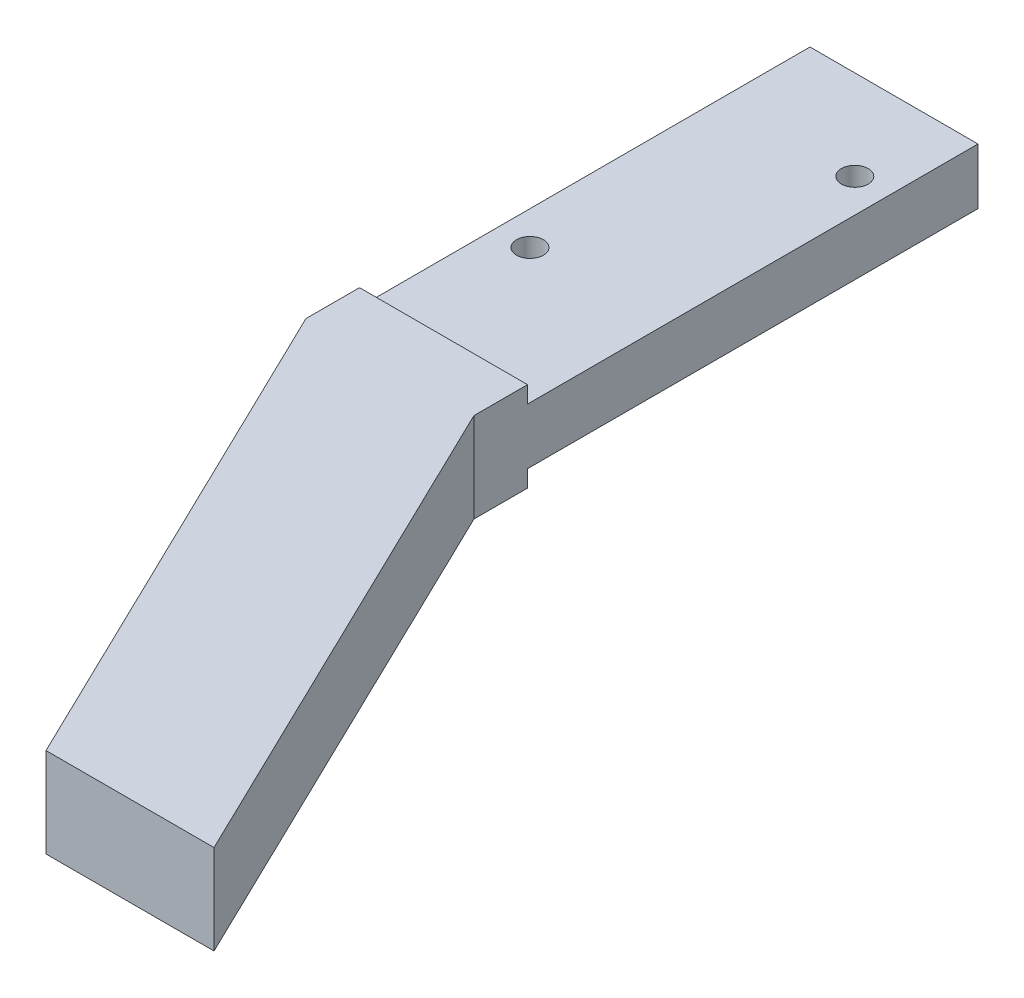
ISO-10303-21;
HEADER;
FILE_DESCRIPTION(('STEP AP214'),'2;1');
FILE_NAME('part.step','',(''),(''),'','','');
FILE_SCHEMA(('AUTOMOTIVE_DESIGN { 1 0 10303 214 1 1 1 1 }'));
ENDSEC;
DATA;
#1=APPLICATION_CONTEXT('core data for automotive mechanical design processes');
#2=APPLICATION_PROTOCOL_DEFINITION('international standard','automotive_design',2000,#1);
#3=PRODUCT_CONTEXT('',#1,'mechanical');
#4=PRODUCT('Part','Part','',(#3));
#5=PRODUCT_RELATED_PRODUCT_CATEGORY('part','',(#4));
#6=PRODUCT_DEFINITION_FORMATION('','',#4);
#7=PRODUCT_DEFINITION_CONTEXT('part definition',#1,'design');
#8=PRODUCT_DEFINITION('design','',#6,#7);
#9=PRODUCT_DEFINITION_SHAPE('','',#8);
#10=(LENGTH_UNIT() NAMED_UNIT(*) SI_UNIT(.MILLI.,.METRE.));
#11=(NAMED_UNIT(*) PLANE_ANGLE_UNIT() SI_UNIT($,.RADIAN.));
#12=(NAMED_UNIT(*) SI_UNIT($,.STERADIAN.) SOLID_ANGLE_UNIT());
#13=UNCERTAINTY_MEASURE_WITH_UNIT(LENGTH_MEASURE(1.E-05),#10,'distance_accuracy_value','');
#14=(GEOMETRIC_REPRESENTATION_CONTEXT(3) GLOBAL_UNCERTAINTY_ASSIGNED_CONTEXT((#13)) GLOBAL_UNIT_ASSIGNED_CONTEXT((#10,
#11,#12)) REPRESENTATION_CONTEXT('',''));
#15=CARTESIAN_POINT('',(0.,0.,0.));
#16=DIRECTION('',(0.,0.,1.));
#17=DIRECTION('',(1.,0.,0.));
#18=AXIS2_PLACEMENT_3D('',#15,#16,#17);
#19=CARTESIAN_POINT('',(0.,2.5,0.));
#20=DIRECTION('',(0.,1.,0.));
#21=DIRECTION('',(0.,0.,1.));
#22=AXIS2_PLACEMENT_3D('',#19,#20,#21);
#23=PLANE('',#22);
#24=DIRECTION('',(-1.,0.,0.));
#25=VECTOR('',#24,1.);
#26=CARTESIAN_POINT('',(0.,2.5,17.7156622283973));
#27=LINE('',#26,#25);
#28=CARTESIAN_POINT('',(7.5,2.5,17.7156622283973));
#29=VERTEX_POINT('',#28);
#30=CARTESIAN_POINT('',(-7.5,2.5,17.7156622283973));
#31=VERTEX_POINT('',#30);
#32=EDGE_CURVE('E81',#29,#31,#27,.T.);
#33=ORIENTED_EDGE('',*,*,#32,.F.);
#34=DIRECTION('',(0.,0.,-1.));
#35=VECTOR('',#34,1.);
#36=CARTESIAN_POINT('',(7.5,2.5,22.5));
#37=LINE('',#36,#35);
#38=CARTESIAN_POINT('',(7.5,2.5,-22.5));
#39=VERTEX_POINT('',#38);
#40=EDGE_CURVE('E226',#29,#39,#37,.T.);
#41=ORIENTED_EDGE('',*,*,#40,.T.);
#42=DIRECTION('',(-1.,0.,0.));
#43=VECTOR('',#42,1.);
#44=CARTESIAN_POINT('',(7.5,2.5,-22.5));
#45=LINE('',#44,#43);
#46=CARTESIAN_POINT('',(-7.5,2.5,-22.5));
#47=VERTEX_POINT('',#46);
#48=EDGE_CURVE('E61',#39,#47,#45,.T.);
#49=ORIENTED_EDGE('',*,*,#48,.T.);
#50=DIRECTION('',(0.,0.,1.));
#51=VECTOR('',#50,1.);
#52=CARTESIAN_POINT('',(-7.5,2.5,22.5));
#53=LINE('',#52,#51);
#54=EDGE_CURVE('E223',#47,#31,#53,.T.);
#55=ORIENTED_EDGE('',*,*,#54,.T.);
#56=EDGE_LOOP('',(#33,#41,#49,#55));
#57=FACE_BOUND('',#56,.T.);
#58=CARTESIAN_POINT('',(4.5,2.5,-14.5));
#59=DIRECTION('',(0.,1.,0.));
#60=DIRECTION('',(0.,0.,1.));
#61=AXIS2_PLACEMENT_3D('',#58,#59,#60);
#62=CIRCLE('',#61,1.2);
#63=CARTESIAN_POINT('',(4.5,2.5,-13.3));
#64=VERTEX_POINT('',#63);
#65=EDGE_CURVE('E216',#64,#64,#62,.T.);
#66=ORIENTED_EDGE('',*,*,#65,.F.);
#67=EDGE_LOOP('',(#66));
#68=FACE_BOUND('',#67,.T.);
#69=CARTESIAN_POINT('',(-4.5,2.5,5.50000000000001));
#70=DIRECTION('',(0.,1.,0.));
#71=DIRECTION('',(0.,0.,1.));
#72=AXIS2_PLACEMENT_3D('',#69,#70,#71);
#73=CIRCLE('',#72,1.2);
#74=CARTESIAN_POINT('',(-4.5,2.5,6.70000000000001));
#75=VERTEX_POINT('',#74);
#76=EDGE_CURVE('E208',#75,#75,#73,.T.);
#77=ORIENTED_EDGE('',*,*,#76,.F.);
#78=EDGE_LOOP('',(#77));
#79=FACE_BOUND('',#78,.T.);
#80=ADVANCED_FACE('F43',(#57,#68,#79),#23,.T.);
#81=CARTESIAN_POINT('',(0.,-2.5,0.));
#82=DIRECTION('',(0.,1.,0.));
#83=DIRECTION('',(0.,0.,1.));
#84=AXIS2_PLACEMENT_3D('',#81,#82,#83);
#85=PLANE('',#84);
#86=DIRECTION('',(0.,0.,-1.));
#87=VECTOR('',#86,1.);
#88=CARTESIAN_POINT('',(7.5,-2.5,22.5));
#89=LINE('',#88,#87);
#90=CARTESIAN_POINT('',(7.5,-2.5,17.7156622283973));
#91=VERTEX_POINT('',#90);
#92=CARTESIAN_POINT('',(7.5,-2.5,-22.5));
#93=VERTEX_POINT('',#92);
#94=EDGE_CURVE('E72',#91,#93,#89,.T.);
#95=ORIENTED_EDGE('',*,*,#94,.F.);
#96=DIRECTION('',(-1.,0.,0.));
#97=VECTOR('',#96,1.);
#98=CARTESIAN_POINT('',(0.,-2.5,17.7156622283973));
#99=LINE('',#98,#97);
#100=CARTESIAN_POINT('',(-7.5,-2.5,17.7156622283973));
#101=VERTEX_POINT('',#100);
#102=EDGE_CURVE('E196',#91,#101,#99,.T.);
#103=ORIENTED_EDGE('',*,*,#102,.T.);
#104=DIRECTION('',(0.,0.,1.));
#105=VECTOR('',#104,1.);
#106=CARTESIAN_POINT('',(-7.5,-2.5,22.5));
#107=LINE('',#106,#105);
#108=CARTESIAN_POINT('',(-7.5,-2.5,-22.5));
#109=VERTEX_POINT('',#108);
#110=EDGE_CURVE('E132',#109,#101,#107,.T.);
#111=ORIENTED_EDGE('',*,*,#110,.F.);
#112=DIRECTION('',(-1.,0.,0.));
#113=VECTOR('',#112,1.);
#114=CARTESIAN_POINT('',(7.5,-2.5,-22.5));
#115=LINE('',#114,#113);
#116=EDGE_CURVE('E227',#93,#109,#115,.T.);
#117=ORIENTED_EDGE('',*,*,#116,.F.);
#118=EDGE_LOOP('',(#95,#103,#111,#117));
#119=FACE_BOUND('',#118,.T.);
#120=CARTESIAN_POINT('',(4.5,-2.5,-14.5));
#121=DIRECTION('',(0.,1.,0.));
#122=DIRECTION('',(0.,0.,1.));
#123=AXIS2_PLACEMENT_3D('',#120,#121,#122);
#124=CIRCLE('',#123,1.2);
#125=CARTESIAN_POINT('',(4.5,-2.5,-13.3));
#126=VERTEX_POINT('',#125);
#127=EDGE_CURVE('E212',#126,#126,#124,.T.);
#128=ORIENTED_EDGE('',*,*,#127,.T.);
#129=EDGE_LOOP('',(#128));
#130=FACE_BOUND('',#129,.T.);
#131=CARTESIAN_POINT('',(-4.5,-2.5,5.50000000000001));
#132=DIRECTION('',(0.,1.,0.));
#133=DIRECTION('',(0.,0.,1.));
#134=AXIS2_PLACEMENT_3D('',#131,#132,#133);
#135=CIRCLE('',#134,1.2);
#136=CARTESIAN_POINT('',(-4.5,-2.5,6.70000000000001));
#137=VERTEX_POINT('',#136);
#138=EDGE_CURVE('E207',#137,#137,#135,.T.);
#139=ORIENTED_EDGE('',*,*,#138,.T.);
#140=EDGE_LOOP('',(#139));
#141=FACE_BOUND('',#140,.T.);
#142=ADVANCED_FACE('F269',(#119,#130,#141),#85,.F.);
#143=CARTESIAN_POINT('',(-7.5,2.5,22.5));
#144=DIRECTION('',(1.,0.,0.));
#145=DIRECTION('',(0.,0.,-1.));
#146=AXIS2_PLACEMENT_3D('',#143,#144,#145);
#147=PLANE('',#146);
#148=ORIENTED_EDGE('',*,*,#110,.T.);
#149=DIRECTION('',(0.,1.,0.));
#150=VECTOR('',#149,1.);
#151=CARTESIAN_POINT('',(-7.5,-4.,17.7156622283973));
#152=LINE('',#151,#150);
#153=CARTESIAN_POINT('',(-7.5,-4.,17.7156622283973));
#154=VERTEX_POINT('',#153);
#155=EDGE_CURVE('E127',#154,#101,#152,.T.);
#156=ORIENTED_EDGE('',*,*,#155,.F.);
#157=DIRECTION('',(0.,0.,1.));
#158=VECTOR('',#157,1.);
#159=CARTESIAN_POINT('',(-7.5,-4.,17.7156622283973));
#160=LINE('',#159,#158);
#161=CARTESIAN_POINT('',(-7.5,-4.,22.5));
#162=VERTEX_POINT('',#161);
#163=EDGE_CURVE('E129',#154,#162,#160,.T.);
#164=ORIENTED_EDGE('',*,*,#163,.T.);
#165=DIRECTION('',(0.,-1.,0.));
#166=VECTOR('',#165,1.);
#167=CARTESIAN_POINT('',(-7.5,2.5,22.5));
#168=LINE('',#167,#166);
#169=CARTESIAN_POINT('',(-7.5,4.,22.5));
#170=VERTEX_POINT('',#169);
#171=EDGE_CURVE('E11',#170,#162,#168,.T.);
#172=ORIENTED_EDGE('',*,*,#171,.F.);
#173=DIRECTION('',(0.,0.,1.));
#174=VECTOR('',#173,1.);
#175=CARTESIAN_POINT('',(-7.5,4.,17.7156622283973));
#176=LINE('',#175,#174);
#177=CARTESIAN_POINT('',(-7.5,4.,17.7156622283973));
#178=VERTEX_POINT('',#177);
#179=EDGE_CURVE('E179',#178,#170,#176,.T.);
#180=ORIENTED_EDGE('',*,*,#179,.F.);
#181=EDGE_CURVE('E138',#31,#178,#152,.T.);
#182=ORIENTED_EDGE('',*,*,#181,.F.);
#183=ORIENTED_EDGE('',*,*,#54,.F.);
#184=DIRECTION('',(0.,-1.,0.));
#185=VECTOR('',#184,1.);
#186=CARTESIAN_POINT('',(-7.5,2.5,-22.5));
#187=LINE('',#186,#185);
#188=EDGE_CURVE('E232',#47,#109,#187,.T.);
#189=ORIENTED_EDGE('',*,*,#188,.T.);
#190=EDGE_LOOP('',(#148,#156,#164,#172,#180,#182,#183,#189));
#191=FACE_BOUND('',#190,.T.);
#192=ADVANCED_FACE('F45',(#191),#147,.F.);
#193=CARTESIAN_POINT('',(7.5,2.5,22.5));
#194=DIRECTION('',(-1.,0.,0.));
#195=DIRECTION('',(0.,0.,1.));
#196=AXIS2_PLACEMENT_3D('',#193,#194,#195);
#197=PLANE('',#196);
#198=ORIENTED_EDGE('',*,*,#40,.F.);
#199=DIRECTION('',(0.,1.,0.));
#200=VECTOR('',#199,1.);
#201=CARTESIAN_POINT('',(7.5,-4.,17.7156622283973));
#202=LINE('',#201,#200);
#203=CARTESIAN_POINT('',(7.5,4.,17.7156622283973));
#204=VERTEX_POINT('',#203);
#205=EDGE_CURVE('E197',#29,#204,#202,.T.);
#206=ORIENTED_EDGE('',*,*,#205,.T.);
#207=DIRECTION('',(0.,0.,-1.));
#208=VECTOR('',#207,1.);
#209=CARTESIAN_POINT('',(7.5,4.,17.7156622283973));
#210=LINE('',#209,#208);
#211=CARTESIAN_POINT('',(7.5,4.,22.5));
#212=VERTEX_POINT('',#211);
#213=EDGE_CURVE('E155',#212,#204,#210,.T.);
#214=ORIENTED_EDGE('',*,*,#213,.F.);
#215=DIRECTION('',(0.,-1.,0.));
#216=VECTOR('',#215,1.);
#217=CARTESIAN_POINT('',(7.5,2.5,22.5));
#218=LINE('',#217,#216);
#219=CARTESIAN_POINT('',(7.5,-4.,22.5));
#220=VERTEX_POINT('',#219);
#221=EDGE_CURVE('E53',#212,#220,#218,.T.);
#222=ORIENTED_EDGE('',*,*,#221,.T.);
#223=DIRECTION('',(0.,0.,-1.));
#224=VECTOR('',#223,1.);
#225=CARTESIAN_POINT('',(7.5,-4.,17.7156622283973));
#226=LINE('',#225,#224);
#227=CARTESIAN_POINT('',(7.5,-4.,17.7156622283973));
#228=VERTEX_POINT('',#227);
#229=EDGE_CURVE('E172',#220,#228,#226,.T.);
#230=ORIENTED_EDGE('',*,*,#229,.T.);
#231=EDGE_CURVE('E153',#228,#91,#202,.T.);
#232=ORIENTED_EDGE('',*,*,#231,.T.);
#233=ORIENTED_EDGE('',*,*,#94,.T.);
#234=DIRECTION('',(0.,-1.,0.));
#235=VECTOR('',#234,1.);
#236=CARTESIAN_POINT('',(7.5,2.5,-22.5));
#237=LINE('',#236,#235);
#238=EDGE_CURVE('E241',#39,#93,#237,.T.);
#239=ORIENTED_EDGE('',*,*,#238,.F.);
#240=EDGE_LOOP('',(#198,#206,#214,#222,#230,#232,#233,#239));
#241=FACE_BOUND('',#240,.T.);
#242=ADVANCED_FACE('F246',(#241),#197,.F.);
#243=CARTESIAN_POINT('',(7.5,2.5,-22.5));
#244=DIRECTION('',(0.,0.,1.));
#245=DIRECTION('',(1.,0.,0.));
#246=AXIS2_PLACEMENT_3D('',#243,#244,#245);
#247=PLANE('',#246);
#248=ORIENTED_EDGE('',*,*,#116,.T.);
#249=ORIENTED_EDGE('',*,*,#188,.F.);
#250=ORIENTED_EDGE('',*,*,#48,.F.);
#251=ORIENTED_EDGE('',*,*,#238,.T.);
#252=EDGE_LOOP('',(#248,#249,#250,#251));
#253=FACE_BOUND('',#252,.T.);
#254=ADVANCED_FACE('F271',(#253),#247,.F.);
#255=CARTESIAN_POINT('',(4.5,2.5,-14.5));
#256=DIRECTION('',(0.,-1.,0.));
#257=DIRECTION('',(0.,0.,-1.));
#258=AXIS2_PLACEMENT_3D('',#255,#256,#257);
#259=CYLINDRICAL_SURFACE('',#258,1.2);
#260=ORIENTED_EDGE('',*,*,#65,.T.);
#261=EDGE_LOOP('',(#260));
#262=FACE_BOUND('',#261,.T.);
#263=ORIENTED_EDGE('',*,*,#127,.F.);
#264=EDGE_LOOP('',(#263));
#265=FACE_BOUND('',#264,.T.);
#266=ADVANCED_FACE('F273',(#262,#265),#259,.F.);
#267=CARTESIAN_POINT('',(-4.5,2.5,5.50000000000001));
#268=DIRECTION('',(0.,-1.,0.));
#269=DIRECTION('',(0.,0.,-1.));
#270=AXIS2_PLACEMENT_3D('',#267,#268,#269);
#271=CYLINDRICAL_SURFACE('',#270,1.2);
#272=ORIENTED_EDGE('',*,*,#76,.T.);
#273=EDGE_LOOP('',(#272));
#274=FACE_BOUND('',#273,.T.);
#275=ORIENTED_EDGE('',*,*,#138,.F.);
#276=EDGE_LOOP('',(#275));
#277=FACE_BOUND('',#276,.T.);
#278=ADVANCED_FACE('F278',(#274,#277),#271,.F.);
#279=CARTESIAN_POINT('',(-7.5,-4.,17.7156622283973));
#280=DIRECTION('',(0.,0.,-1.));
#281=DIRECTION('',(-1.,0.,0.));
#282=AXIS2_PLACEMENT_3D('',#279,#280,#281);
#283=PLANE('',#282);
#284=ORIENTED_EDGE('',*,*,#102,.F.);
#285=ORIENTED_EDGE('',*,*,#231,.F.);
#286=DIRECTION('',(-1.,0.,0.));
#287=VECTOR('',#286,1.);
#288=CARTESIAN_POINT('',(-7.5,-4.,17.7156622283973));
#289=LINE('',#288,#287);
#290=EDGE_CURVE('E145',#228,#154,#289,.T.);
#291=ORIENTED_EDGE('',*,*,#290,.T.);
#292=ORIENTED_EDGE('',*,*,#155,.T.);
#293=EDGE_LOOP('',(#284,#285,#291,#292));
#294=FACE_BOUND('',#293,.T.);
#295=ADVANCED_FACE('F152',(#294),#283,.T.);
#296=ORIENTED_EDGE('',*,*,#205,.F.);
#297=ORIENTED_EDGE('',*,*,#32,.T.);
#298=ORIENTED_EDGE('',*,*,#181,.T.);
#299=DIRECTION('',(-1.,0.,0.));
#300=VECTOR('',#299,1.);
#301=CARTESIAN_POINT('',(-7.5,4.,17.7156622283973));
#302=LINE('',#301,#300);
#303=EDGE_CURVE('E175',#204,#178,#302,.T.);
#304=ORIENTED_EDGE('',*,*,#303,.F.);
#305=EDGE_LOOP('',(#296,#297,#298,#304));
#306=FACE_BOUND('',#305,.T.);
#307=ADVANCED_FACE('F262',(#306),#283,.T.);
#308=CARTESIAN_POINT('',(29.2944947177034,-4.,67.5));
#309=DIRECTION('',(0.9,0.,-0.435889894354068));
#310=DIRECTION('',(-0.435889894354068,0.,-0.9));
#311=AXIS2_PLACEMENT_3D('',#308,#309,#310);
#312=PLANE('',#311);
#313=DIRECTION('',(-0.435889894354068,0.,-0.9));
#314=VECTOR('',#313,1.);
#315=CARTESIAN_POINT('',(29.2944947177034,4.,67.5));
#316=LINE('',#315,#314);
#317=CARTESIAN_POINT('',(29.2944947177034,4.,67.5));
#318=VERTEX_POINT('',#317);
#319=EDGE_CURVE('E159',#318,#212,#316,.T.);
#320=ORIENTED_EDGE('',*,*,#319,.F.);
#321=DIRECTION('',(0.,1.,0.));
#322=VECTOR('',#321,1.);
#323=CARTESIAN_POINT('',(29.2944947177034,-4.,67.5));
#324=LINE('',#323,#322);
#325=CARTESIAN_POINT('',(29.2944947177034,-4.,67.5));
#326=VERTEX_POINT('',#325);
#327=EDGE_CURVE('E198',#326,#318,#324,.T.);
#328=ORIENTED_EDGE('',*,*,#327,.F.);
#329=DIRECTION('',(-0.435889894354068,0.,-0.9));
#330=VECTOR('',#329,1.);
#331=CARTESIAN_POINT('',(29.2944947177034,-4.,67.5));
#332=LINE('',#331,#330);
#333=EDGE_CURVE('E168',#326,#220,#332,.T.);
#334=ORIENTED_EDGE('',*,*,#333,.T.);
#335=ORIENTED_EDGE('',*,*,#221,.F.);
#336=EDGE_LOOP('',(#320,#328,#334,#335));
#337=FACE_BOUND('',#336,.T.);
#338=ADVANCED_FACE('F250',(#337),#312,.T.);
#339=CARTESIAN_POINT('',(14.2944947177034,-4.,67.5));
#340=DIRECTION('',(0.,0.,1.));
#341=DIRECTION('',(1.,0.,0.));
#342=AXIS2_PLACEMENT_3D('',#339,#340,#341);
#343=PLANE('',#342);
#344=DIRECTION('',(1.,0.,0.));
#345=VECTOR('',#344,1.);
#346=CARTESIAN_POINT('',(14.2944947177034,4.,67.5));
#347=LINE('',#346,#345);
#348=CARTESIAN_POINT('',(14.2944947177034,4.,67.5));
#349=VERTEX_POINT('',#348);
#350=EDGE_CURVE('E187',#349,#318,#347,.T.);
#351=ORIENTED_EDGE('',*,*,#350,.F.);
#352=DIRECTION('',(0.,1.,0.));
#353=VECTOR('',#352,1.);
#354=CARTESIAN_POINT('',(14.2944947177034,-4.,67.5));
#355=LINE('',#354,#353);
#356=CARTESIAN_POINT('',(14.2944947177034,-4.,67.5));
#357=VERTEX_POINT('',#356);
#358=EDGE_CURVE('E137',#357,#349,#355,.T.);
#359=ORIENTED_EDGE('',*,*,#358,.F.);
#360=DIRECTION('',(1.,0.,0.));
#361=VECTOR('',#360,1.);
#362=CARTESIAN_POINT('',(14.2944947177034,-4.,67.5));
#363=LINE('',#362,#361);
#364=EDGE_CURVE('E164',#357,#326,#363,.T.);
#365=ORIENTED_EDGE('',*,*,#364,.T.);
#366=ORIENTED_EDGE('',*,*,#327,.T.);
#367=EDGE_LOOP('',(#351,#359,#365,#366));
#368=FACE_BOUND('',#367,.T.);
#369=ADVANCED_FACE('F253',(#368),#343,.T.);
#370=CARTESIAN_POINT('',(-7.5,-4.,22.5));
#371=DIRECTION('',(-0.9,0.,0.435889894354068));
#372=DIRECTION('',(0.435889894354068,0.,0.9));
#373=AXIS2_PLACEMENT_3D('',#370,#371,#372);
#374=PLANE('',#373);
#375=DIRECTION('',(0.435889894354068,0.,0.9));
#376=VECTOR('',#375,1.);
#377=CARTESIAN_POINT('',(-7.5,4.,22.5));
#378=LINE('',#377,#376);
#379=EDGE_CURVE('E183',#170,#349,#378,.T.);
#380=ORIENTED_EDGE('',*,*,#379,.F.);
#381=ORIENTED_EDGE('',*,*,#171,.T.);
#382=DIRECTION('',(0.435889894354068,0.,0.9));
#383=VECTOR('',#382,1.);
#384=CARTESIAN_POINT('',(-7.5,-4.,22.5));
#385=LINE('',#384,#383);
#386=EDGE_CURVE('E149',#162,#357,#385,.T.);
#387=ORIENTED_EDGE('',*,*,#386,.T.);
#388=ORIENTED_EDGE('',*,*,#358,.T.);
#389=EDGE_LOOP('',(#380,#381,#387,#388));
#390=FACE_BOUND('',#389,.T.);
#391=ADVANCED_FACE('F256',(#390),#374,.T.);
#392=CARTESIAN_POINT('',(0.,-4.,0.));
#393=DIRECTION('',(0.,-1.,0.));
#394=DIRECTION('',(0.,0.,-1.));
#395=AXIS2_PLACEMENT_3D('',#392,#393,#394);
#396=PLANE('',#395);
#397=ORIENTED_EDGE('',*,*,#290,.F.);
#398=ORIENTED_EDGE('',*,*,#229,.F.);
#399=ORIENTED_EDGE('',*,*,#333,.F.);
#400=ORIENTED_EDGE('',*,*,#364,.F.);
#401=ORIENTED_EDGE('',*,*,#386,.F.);
#402=ORIENTED_EDGE('',*,*,#163,.F.);
#403=EDGE_LOOP('',(#397,#398,#399,#400,#401,#402));
#404=FACE_BOUND('',#403,.T.);
#405=ADVANCED_FACE('F143',(#404),#396,.T.);
#406=CARTESIAN_POINT('',(0.,4.,0.));
#407=DIRECTION('',(0.,-1.,0.));
#408=DIRECTION('',(0.,0.,-1.));
#409=AXIS2_PLACEMENT_3D('',#406,#407,#408);
#410=PLANE('',#409);
#411=ORIENTED_EDGE('',*,*,#303,.T.);
#412=ORIENTED_EDGE('',*,*,#179,.T.);
#413=ORIENTED_EDGE('',*,*,#379,.T.);
#414=ORIENTED_EDGE('',*,*,#350,.T.);
#415=ORIENTED_EDGE('',*,*,#319,.T.);
#416=ORIENTED_EDGE('',*,*,#213,.T.);
#417=EDGE_LOOP('',(#411,#412,#413,#414,#415,#416));
#418=FACE_BOUND('',#417,.T.);
#419=ADVANCED_FACE('F261',(#418),#410,.F.);
#420=CLOSED_SHELL('',(#80,#142,#192,#242,#254,#266,#278,#295,#307,#338,#369,#391,#405,#419));
#421=MANIFOLD_SOLID_BREP('B2',#420);
#422=ADVANCED_BREP_SHAPE_REPRESENTATION('',(#18,#421),#14);
#423=SHAPE_DEFINITION_REPRESENTATION(#9,#422);
ENDSEC;
END-ISO-10303-21;
